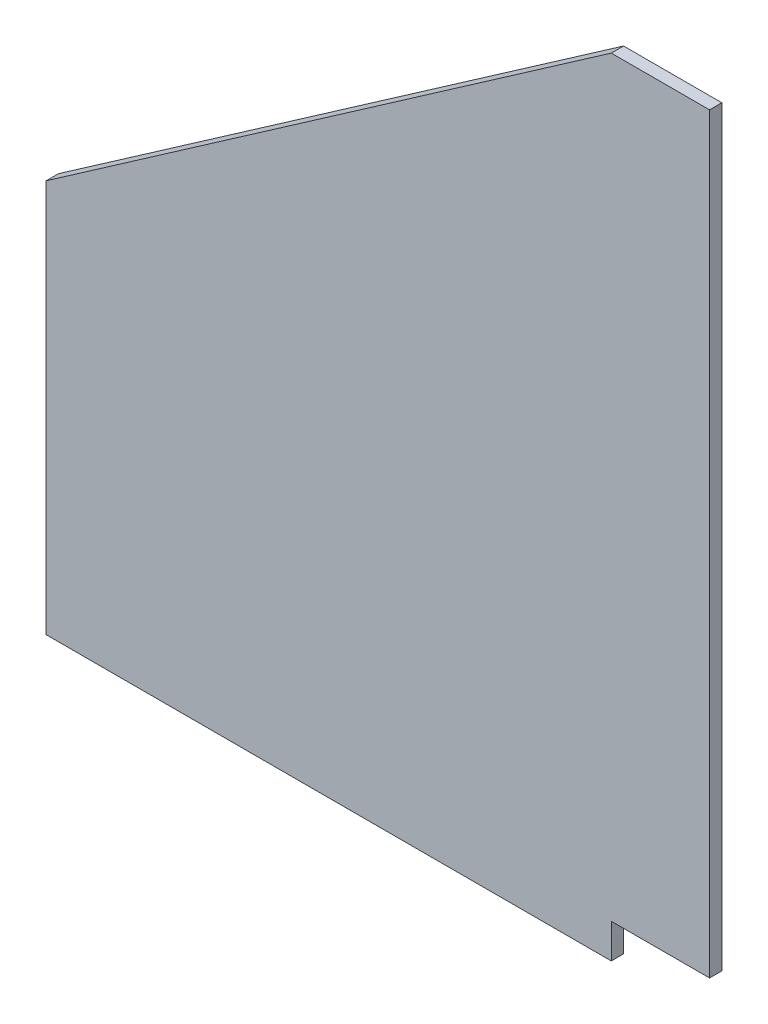
ISO-10303-21;
HEADER;
FILE_DESCRIPTION(('STEP AP214'),'2;1');
FILE_NAME('part.step','',(''),(''),'','','');
FILE_SCHEMA(('AUTOMOTIVE_DESIGN { 1 0 10303 214 1 1 1 1 }'));
ENDSEC;
DATA;
#1=APPLICATION_CONTEXT('core data for automotive mechanical design processes');
#2=APPLICATION_PROTOCOL_DEFINITION('international standard','automotive_design',2000,#1);
#3=PRODUCT_CONTEXT('',#1,'mechanical');
#4=PRODUCT('Part','Part','',(#3));
#5=PRODUCT_RELATED_PRODUCT_CATEGORY('part','',(#4));
#6=PRODUCT_DEFINITION_FORMATION('','',#4);
#7=PRODUCT_DEFINITION_CONTEXT('part definition',#1,'design');
#8=PRODUCT_DEFINITION('design','',#6,#7);
#9=PRODUCT_DEFINITION_SHAPE('','',#8);
#10=(LENGTH_UNIT() NAMED_UNIT(*) SI_UNIT(.MILLI.,.METRE.));
#11=(NAMED_UNIT(*) PLANE_ANGLE_UNIT() SI_UNIT($,.RADIAN.));
#12=(NAMED_UNIT(*) SI_UNIT($,.STERADIAN.) SOLID_ANGLE_UNIT());
#13=UNCERTAINTY_MEASURE_WITH_UNIT(LENGTH_MEASURE(1.E-05),#10,'distance_accuracy_value','');
#14=(GEOMETRIC_REPRESENTATION_CONTEXT(3) GLOBAL_UNCERTAINTY_ASSIGNED_CONTEXT((#13)) GLOBAL_UNIT_ASSIGNED_CONTEXT((#10,
#11,#12)) REPRESENTATION_CONTEXT('',''));
#15=CARTESIAN_POINT('',(0.,0.,0.));
#16=DIRECTION('',(0.,0.,1.));
#17=DIRECTION('',(1.,0.,0.));
#18=AXIS2_PLACEMENT_3D('',#15,#16,#17);
#19=CARTESIAN_POINT('',(-25.4,0.,3.175));
#20=DIRECTION('',(0.,1.,0.));
#21=DIRECTION('',(0.,0.,1.));
#22=AXIS2_PLACEMENT_3D('',#19,#20,#21);
#23=PLANE('',#22);
#24=DIRECTION('',(1.,0.,0.));
#25=VECTOR('',#24,1.);
#26=CARTESIAN_POINT('',(-25.4,0.,0.));
#27=LINE('',#26,#25);
#28=CARTESIAN_POINT('',(-25.4,0.,0.));
#29=VERTEX_POINT('',#28);
#30=CARTESIAN_POINT('',(0.,0.,0.));
#31=VERTEX_POINT('',#30);
#32=EDGE_CURVE('E126',#29,#31,#27,.T.);
#33=ORIENTED_EDGE('',*,*,#32,.T.);
#34=DIRECTION('',(0.,0.,-1.));
#35=VECTOR('',#34,1.);
#36=CARTESIAN_POINT('',(0.,0.,3.175));
#37=LINE('',#36,#35);
#38=CARTESIAN_POINT('',(0.,0.,3.175));
#39=VERTEX_POINT('',#38);
#40=EDGE_CURVE('E11',#39,#31,#37,.T.);
#41=ORIENTED_EDGE('',*,*,#40,.F.);
#42=DIRECTION('',(1.,0.,0.));
#43=VECTOR('',#42,1.);
#44=CARTESIAN_POINT('',(-25.4,0.,3.175));
#45=LINE('',#44,#43);
#46=CARTESIAN_POINT('',(-25.4,0.,3.175));
#47=VERTEX_POINT('',#46);
#48=EDGE_CURVE('E138',#47,#39,#45,.T.);
#49=ORIENTED_EDGE('',*,*,#48,.F.);
#50=DIRECTION('',(0.,0.,-1.));
#51=VECTOR('',#50,1.);
#52=CARTESIAN_POINT('',(-25.4,0.,3.175));
#53=LINE('',#52,#51);
#54=EDGE_CURVE('E122',#47,#29,#53,.T.);
#55=ORIENTED_EDGE('',*,*,#54,.T.);
#56=EDGE_LOOP('',(#33,#41,#49,#55));
#57=FACE_BOUND('',#56,.T.);
#58=ADVANCED_FACE('F36',(#57),#23,.F.);
#59=CARTESIAN_POINT('',(0.,0.,3.175));
#60=DIRECTION('',(-1.,0.,0.));
#61=DIRECTION('',(0.,0.,1.));
#62=AXIS2_PLACEMENT_3D('',#59,#60,#61);
#63=PLANE('',#62);
#64=DIRECTION('',(0.,1.,0.));
#65=VECTOR('',#64,1.);
#66=CARTESIAN_POINT('',(0.,0.,0.));
#67=LINE('',#66,#65);
#68=CARTESIAN_POINT('',(0.,194.31,0.));
#69=VERTEX_POINT('',#68);
#70=EDGE_CURVE('E129',#31,#69,#67,.T.);
#71=ORIENTED_EDGE('',*,*,#70,.T.);
#72=DIRECTION('',(0.,0.,-1.));
#73=VECTOR('',#72,1.);
#74=CARTESIAN_POINT('',(0.,194.31,3.175));
#75=LINE('',#74,#73);
#76=CARTESIAN_POINT('',(0.,194.31,3.175));
#77=VERTEX_POINT('',#76);
#78=EDGE_CURVE('E44',#77,#69,#75,.T.);
#79=ORIENTED_EDGE('',*,*,#78,.F.);
#80=DIRECTION('',(0.,1.,0.));
#81=VECTOR('',#80,1.);
#82=CARTESIAN_POINT('',(0.,0.,3.175));
#83=LINE('',#82,#81);
#84=EDGE_CURVE('E92',#39,#77,#83,.T.);
#85=ORIENTED_EDGE('',*,*,#84,.F.);
#86=ORIENTED_EDGE('',*,*,#40,.T.);
#87=EDGE_LOOP('',(#71,#79,#85,#86));
#88=FACE_BOUND('',#87,.T.);
#89=ADVANCED_FACE('F163',(#88),#63,.F.);
#90=CARTESIAN_POINT('',(0.,194.31,3.175));
#91=DIRECTION('',(0.,-1.,0.));
#92=DIRECTION('',(0.,0.,-1.));
#93=AXIS2_PLACEMENT_3D('',#90,#91,#92);
#94=PLANE('',#93);
#95=DIRECTION('',(-1.,0.,0.));
#96=VECTOR('',#95,1.);
#97=CARTESIAN_POINT('',(0.,194.31,0.));
#98=LINE('',#97,#96);
#99=CARTESIAN_POINT('',(-25.4,194.31,0.));
#100=VERTEX_POINT('',#99);
#101=EDGE_CURVE('E131',#69,#100,#98,.T.);
#102=ORIENTED_EDGE('',*,*,#101,.T.);
#103=DIRECTION('',(0.,0.,-1.));
#104=VECTOR('',#103,1.);
#105=CARTESIAN_POINT('',(-25.4,194.31,3.175));
#106=LINE('',#105,#104);
#107=CARTESIAN_POINT('',(-25.4,194.31,3.175));
#108=VERTEX_POINT('',#107);
#109=EDGE_CURVE('E142',#108,#100,#106,.T.);
#110=ORIENTED_EDGE('',*,*,#109,.F.);
#111=DIRECTION('',(-1.,0.,0.));
#112=VECTOR('',#111,1.);
#113=CARTESIAN_POINT('',(0.,194.31,3.175));
#114=LINE('',#113,#112);
#115=EDGE_CURVE('E150',#77,#108,#114,.T.);
#116=ORIENTED_EDGE('',*,*,#115,.F.);
#117=ORIENTED_EDGE('',*,*,#78,.T.);
#118=EDGE_LOOP('',(#102,#110,#116,#117));
#119=FACE_BOUND('',#118,.T.);
#120=ADVANCED_FACE('F148',(#119),#94,.F.);
#121=CARTESIAN_POINT('',(-171.45,92.71,3.175));
#122=DIRECTION('',(0.5710644881986,-0.820905201785487,0.));
#123=DIRECTION('',(0.820905201785487,0.5710644881986,0.));
#124=AXIS2_PLACEMENT_3D('',#121,#122,#123);
#125=PLANE('',#124);
#126=DIRECTION('',(-0.820905201785487,-0.5710644881986,0.));
#127=VECTOR('',#126,1.);
#128=CARTESIAN_POINT('',(-171.45,92.71,0.));
#129=LINE('',#128,#127);
#130=CARTESIAN_POINT('',(-171.45,92.71,0.));
#131=VERTEX_POINT('',#130);
#132=EDGE_CURVE('E133',#100,#131,#129,.T.);
#133=ORIENTED_EDGE('',*,*,#132,.T.);
#134=DIRECTION('',(0.,0.,-1.));
#135=VECTOR('',#134,1.);
#136=CARTESIAN_POINT('',(-171.45,92.71,3.175));
#137=LINE('',#136,#135);
#138=CARTESIAN_POINT('',(-171.45,92.71,3.175));
#139=VERTEX_POINT('',#138);
#140=EDGE_CURVE('E117',#139,#131,#137,.T.);
#141=ORIENTED_EDGE('',*,*,#140,.F.);
#142=DIRECTION('',(-0.820905201785487,-0.5710644881986,0.));
#143=VECTOR('',#142,1.);
#144=CARTESIAN_POINT('',(-171.45,92.71,3.175));
#145=LINE('',#144,#143);
#146=EDGE_CURVE('E108',#108,#139,#145,.T.);
#147=ORIENTED_EDGE('',*,*,#146,.F.);
#148=ORIENTED_EDGE('',*,*,#109,.T.);
#149=EDGE_LOOP('',(#133,#141,#147,#148));
#150=FACE_BOUND('',#149,.T.);
#151=ADVANCED_FACE('F156',(#150),#125,.F.);
#152=CARTESIAN_POINT('',(-171.45,-8.88999999999998,3.175));
#153=DIRECTION('',(1.,0.,0.));
#154=DIRECTION('',(0.,0.,-1.));
#155=AXIS2_PLACEMENT_3D('',#152,#153,#154);
#156=PLANE('',#155);
#157=DIRECTION('',(0.,-1.,0.));
#158=VECTOR('',#157,1.);
#159=CARTESIAN_POINT('',(-171.45,-8.88999999999998,0.));
#160=LINE('',#159,#158);
#161=CARTESIAN_POINT('',(-171.45,-8.88999999999998,0.));
#162=VERTEX_POINT('',#161);
#163=EDGE_CURVE('E116',#131,#162,#160,.T.);
#164=ORIENTED_EDGE('',*,*,#163,.T.);
#165=DIRECTION('',(0.,0.,-1.));
#166=VECTOR('',#165,1.);
#167=CARTESIAN_POINT('',(-171.45,-8.88999999999998,3.175));
#168=LINE('',#167,#166);
#169=CARTESIAN_POINT('',(-171.45,-8.88999999999998,3.175));
#170=VERTEX_POINT('',#169);
#171=EDGE_CURVE('E113',#170,#162,#168,.T.);
#172=ORIENTED_EDGE('',*,*,#171,.F.);
#173=DIRECTION('',(0.,-1.,0.));
#174=VECTOR('',#173,1.);
#175=CARTESIAN_POINT('',(-171.45,-8.88999999999998,3.175));
#176=LINE('',#175,#174);
#177=EDGE_CURVE('E102',#139,#170,#176,.T.);
#178=ORIENTED_EDGE('',*,*,#177,.F.);
#179=ORIENTED_EDGE('',*,*,#140,.T.);
#180=EDGE_LOOP('',(#164,#172,#178,#179));
#181=FACE_BOUND('',#180,.T.);
#182=ADVANCED_FACE('F114',(#181),#156,.F.);
#183=CARTESIAN_POINT('',(-171.45,-8.88999999999998,3.175));
#184=DIRECTION('',(0.,1.,0.));
#185=DIRECTION('',(-1.,0.,0.));
#186=AXIS2_PLACEMENT_3D('',#183,#184,#185);
#187=PLANE('',#186);
#188=DIRECTION('',(1.,0.,0.));
#189=VECTOR('',#188,1.);
#190=CARTESIAN_POINT('',(-171.45,-8.88999999999998,0.));
#191=LINE('',#190,#189);
#192=CARTESIAN_POINT('',(-25.4,-8.88999999999998,0.));
#193=VERTEX_POINT('',#192);
#194=EDGE_CURVE('E78',#162,#193,#191,.T.);
#195=ORIENTED_EDGE('',*,*,#194,.T.);
#196=DIRECTION('',(0.,0.,-1.));
#197=VECTOR('',#196,1.);
#198=CARTESIAN_POINT('',(-25.4,-8.88999999999998,3.175));
#199=LINE('',#198,#197);
#200=CARTESIAN_POINT('',(-25.4,-8.88999999999998,3.175));
#201=VERTEX_POINT('',#200);
#202=EDGE_CURVE('E118',#201,#193,#199,.T.);
#203=ORIENTED_EDGE('',*,*,#202,.F.);
#204=DIRECTION('',(1.,0.,0.));
#205=VECTOR('',#204,1.);
#206=CARTESIAN_POINT('',(-171.45,-8.88999999999998,3.175));
#207=LINE('',#206,#205);
#208=EDGE_CURVE('E106',#170,#201,#207,.T.);
#209=ORIENTED_EDGE('',*,*,#208,.F.);
#210=ORIENTED_EDGE('',*,*,#171,.T.);
#211=EDGE_LOOP('',(#195,#203,#209,#210));
#212=FACE_BOUND('',#211,.T.);
#213=ADVANCED_FACE('F120',(#212),#187,.F.);
#214=CARTESIAN_POINT('',(-25.4,-8.88999999999998,3.175));
#215=DIRECTION('',(-1.,0.,0.));
#216=DIRECTION('',(0.,0.,1.));
#217=AXIS2_PLACEMENT_3D('',#214,#215,#216);
#218=PLANE('',#217);
#219=DIRECTION('',(0.,1.,0.));
#220=VECTOR('',#219,1.);
#221=CARTESIAN_POINT('',(-25.4,-8.88999999999998,0.));
#222=LINE('',#221,#220);
#223=EDGE_CURVE('E84',#193,#29,#222,.T.);
#224=ORIENTED_EDGE('',*,*,#223,.T.);
#225=ORIENTED_EDGE('',*,*,#54,.F.);
#226=DIRECTION('',(0.,1.,0.));
#227=VECTOR('',#226,1.);
#228=CARTESIAN_POINT('',(-25.4,-8.88999999999998,3.175));
#229=LINE('',#228,#227);
#230=EDGE_CURVE('E52',#201,#47,#229,.T.);
#231=ORIENTED_EDGE('',*,*,#230,.F.);
#232=ORIENTED_EDGE('',*,*,#202,.T.);
#233=EDGE_LOOP('',(#224,#225,#231,#232));
#234=FACE_BOUND('',#233,.T.);
#235=ADVANCED_FACE('F177',(#234),#218,.F.);
#236=CARTESIAN_POINT('',(0.,0.,3.175));
#237=DIRECTION('',(0.,0.,1.));
#238=DIRECTION('',(1.,0.,0.));
#239=AXIS2_PLACEMENT_3D('',#236,#237,#238);
#240=PLANE('',#239);
#241=ORIENTED_EDGE('',*,*,#48,.T.);
#242=ORIENTED_EDGE('',*,*,#84,.T.);
#243=ORIENTED_EDGE('',*,*,#115,.T.);
#244=ORIENTED_EDGE('',*,*,#146,.T.);
#245=ORIENTED_EDGE('',*,*,#177,.T.);
#246=ORIENTED_EDGE('',*,*,#208,.T.);
#247=ORIENTED_EDGE('',*,*,#230,.T.);
#248=EDGE_LOOP('',(#241,#242,#243,#244,#245,#246,#247));
#249=FACE_BOUND('',#248,.T.);
#250=ADVANCED_FACE('F104',(#249),#240,.T.);
#251=CARTESIAN_POINT('',(0.,0.,0.));
#252=DIRECTION('',(0.,0.,1.));
#253=DIRECTION('',(1.,0.,0.));
#254=AXIS2_PLACEMENT_3D('',#251,#252,#253);
#255=PLANE('',#254);
#256=ORIENTED_EDGE('',*,*,#32,.F.);
#257=ORIENTED_EDGE('',*,*,#223,.F.);
#258=ORIENTED_EDGE('',*,*,#194,.F.);
#259=ORIENTED_EDGE('',*,*,#163,.F.);
#260=ORIENTED_EDGE('',*,*,#132,.F.);
#261=ORIENTED_EDGE('',*,*,#101,.F.);
#262=ORIENTED_EDGE('',*,*,#70,.F.);
#263=EDGE_LOOP('',(#256,#257,#258,#259,#260,#261,#262));
#264=FACE_BOUND('',#263,.T.);
#265=ADVANCED_FACE('F154',(#264),#255,.F.);
#266=CLOSED_SHELL('',(#58,#89,#120,#151,#182,#213,#235,#250,#265));
#267=MANIFOLD_SOLID_BREP('B2',#266);
#268=ADVANCED_BREP_SHAPE_REPRESENTATION('',(#18,#267),#14);
#269=SHAPE_DEFINITION_REPRESENTATION(#9,#268);
ENDSEC;
END-ISO-10303-21;
